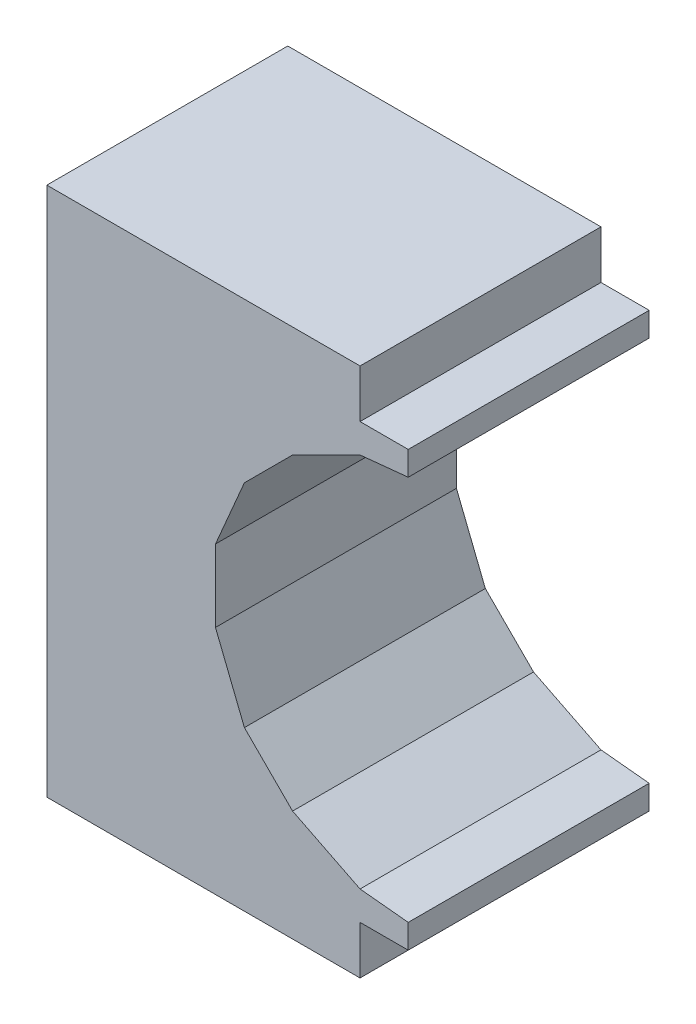
ISO-10303-21;
HEADER;
FILE_DESCRIPTION(('STEP AP214'),'2;1');
FILE_NAME('part.step','',(''),(''),'','','');
FILE_SCHEMA(('AUTOMOTIVE_DESIGN { 1 0 10303 214 1 1 1 1 }'));
ENDSEC;
DATA;
#1=APPLICATION_CONTEXT('core data for automotive mechanical design processes');
#2=APPLICATION_PROTOCOL_DEFINITION('international standard','automotive_design',2000,#1);
#3=PRODUCT_CONTEXT('',#1,'mechanical');
#4=PRODUCT('Part','Part','',(#3));
#5=PRODUCT_RELATED_PRODUCT_CATEGORY('part','',(#4));
#6=PRODUCT_DEFINITION_FORMATION('','',#4);
#7=PRODUCT_DEFINITION_CONTEXT('part definition',#1,'design');
#8=PRODUCT_DEFINITION('design','',#6,#7);
#9=PRODUCT_DEFINITION_SHAPE('','',#8);
#10=(LENGTH_UNIT() NAMED_UNIT(*) SI_UNIT(.MILLI.,.METRE.));
#11=(NAMED_UNIT(*) PLANE_ANGLE_UNIT() SI_UNIT($,.RADIAN.));
#12=(NAMED_UNIT(*) SI_UNIT($,.STERADIAN.) SOLID_ANGLE_UNIT());
#13=UNCERTAINTY_MEASURE_WITH_UNIT(LENGTH_MEASURE(1.E-05),#10,'distance_accuracy_value','');
#14=(GEOMETRIC_REPRESENTATION_CONTEXT(3) GLOBAL_UNCERTAINTY_ASSIGNED_CONTEXT((#13)) GLOBAL_UNIT_ASSIGNED_CONTEXT((#10,
#11,#12)) REPRESENTATION_CONTEXT('',''));
#15=CARTESIAN_POINT('',(0.,0.,0.));
#16=DIRECTION('',(0.,0.,1.));
#17=DIRECTION('',(1.,0.,0.));
#18=AXIS2_PLACEMENT_3D('',#15,#16,#17);
#19=CARTESIAN_POINT('',(0.37500052,-0.4499991,0.5));
#20=DIRECTION('',(0.,0.,-1.));
#21=DIRECTION('',(-1.,0.,0.));
#22=AXIS2_PLACEMENT_3D('',#19,#20,#21);
#23=PLANE('',#22);
#24=DIRECTION('',(-0.995037190209989,0.0995037190209989,0.));
#25=VECTOR('',#24,1.);
#26=CARTESIAN_POINT('',(0.27500072,-0.38999922,0.5));
#27=LINE('',#26,#25);
#28=CARTESIAN_POINT('',(0.27500072,-0.38999922,0.5));
#29=VERTEX_POINT('',#28);
#30=CARTESIAN_POINT('',(0.37500052,-0.3999992,0.5));
#31=VERTEX_POINT('',#30);
#32=EDGE_CURVE('E268',#29,#31,#27,.F.);
#33=ORIENTED_EDGE('',*,*,#32,.F.);
#34=DIRECTION('',(-0.894427190999916,0.447213595499958,0.));
#35=VECTOR('',#34,1.);
#36=CARTESIAN_POINT('',(0.135001,-0.31999936,0.5));
#37=LINE('',#36,#35);
#38=CARTESIAN_POINT('',(0.135001,-0.31999936,0.5));
#39=VERTEX_POINT('',#38);
#40=EDGE_CURVE('E261',#39,#29,#37,.F.);
#41=ORIENTED_EDGE('',*,*,#40,.F.);
#42=DIRECTION('',(-0.707106781186548,0.707106781186548,0.));
#43=VECTOR('',#42,1.);
#44=CARTESIAN_POINT('',(0.0350012,-0.21999956,0.5));
#45=LINE('',#44,#43);
#46=CARTESIAN_POINT('',(0.0350012,-0.21999956,0.5));
#47=VERTEX_POINT('',#46);
#48=EDGE_CURVE('E254',#47,#39,#45,.F.);
#49=ORIENTED_EDGE('',*,*,#48,.F.);
#50=DIRECTION('',(-0.371390676354104,0.928476690885259,0.));
#51=VECTOR('',#50,1.);
#52=CARTESIAN_POINT('',(-0.02499868,-0.06999986,0.5));
#53=LINE('',#52,#51);
#54=CARTESIAN_POINT('',(-0.02499868,-0.06999986,0.5));
#55=VERTEX_POINT('',#54);
#56=EDGE_CURVE('E247',#55,#47,#53,.F.);
#57=ORIENTED_EDGE('',*,*,#56,.F.);
#58=DIRECTION('',(0.,1.,0.));
#59=VECTOR('',#58,1.);
#60=CARTESIAN_POINT('',(-0.02499868,0.08000238,0.5));
#61=LINE('',#60,#59);
#62=CARTESIAN_POINT('',(-0.0249986799999908,0.080002379999996,0.5));
#63=VERTEX_POINT('',#62);
#64=EDGE_CURVE('E240',#63,#55,#61,.F.);
#65=ORIENTED_EDGE('',*,*,#64,.F.);
#66=DIRECTION('',(0.393919298579047,0.91914503001811,0.));
#67=VECTOR('',#66,1.);
#68=CARTESIAN_POINT('',(0.0350012,0.2200021,0.5));
#69=LINE('',#68,#67);
#70=CARTESIAN_POINT('',(0.0350012,0.2200021,0.5));
#71=VERTEX_POINT('',#70);
#72=EDGE_CURVE('E233',#71,#63,#69,.F.);
#73=ORIENTED_EDGE('',*,*,#72,.F.);
#74=DIRECTION('',(0.707106781186548,0.707106781186548,0.));
#75=VECTOR('',#74,1.);
#76=CARTESIAN_POINT('',(0.135001,0.3200019,0.5));
#77=LINE('',#76,#75);
#78=CARTESIAN_POINT('',(0.135001,0.3200019,0.5));
#79=VERTEX_POINT('',#78);
#80=EDGE_CURVE('E226',#79,#71,#77,.F.);
#81=ORIENTED_EDGE('',*,*,#80,.F.);
#82=DIRECTION('',(0.894427190999916,0.447213595499958,0.));
#83=VECTOR('',#82,1.);
#84=CARTESIAN_POINT('',(0.27500072,0.39000176,0.5));
#85=LINE('',#84,#83);
#86=CARTESIAN_POINT('',(0.27500072,0.390001759999995,0.5));
#87=VERTEX_POINT('',#86);
#88=EDGE_CURVE('E219',#87,#79,#85,.F.);
#89=ORIENTED_EDGE('',*,*,#88,.F.);
#90=DIRECTION('',(0.995039692277373,0.0994786951691173,0.));
#91=VECTOR('',#90,1.);
#92=CARTESIAN_POINT('',(0.37500052,0.3999992,0.5));
#93=LINE('',#92,#91);
#94=CARTESIAN_POINT('',(0.37500052,0.3999992,0.5));
#95=VERTEX_POINT('',#94);
#96=EDGE_CURVE('E213',#95,#87,#93,.F.);
#97=ORIENTED_EDGE('',*,*,#96,.F.);
#98=DIRECTION('',(0.,1.,0.));
#99=VECTOR('',#98,1.);
#100=CARTESIAN_POINT('',(0.37500052,0.45000164,0.5));
#101=LINE('',#100,#99);
#102=CARTESIAN_POINT('',(0.37500052,0.45000164,0.5));
#103=VERTEX_POINT('',#102);
#104=EDGE_CURVE('E206',#103,#95,#101,.F.);
#105=ORIENTED_EDGE('',*,*,#104,.F.);
#106=DIRECTION('',(1.,0.,0.));
#107=VECTOR('',#106,1.);
#108=CARTESIAN_POINT('',(0.27500072,0.45000164,0.5));
#109=LINE('',#108,#107);
#110=CARTESIAN_POINT('',(0.27500072,0.45000164,0.5));
#111=VERTEX_POINT('',#110);
#112=EDGE_CURVE('E199',#111,#103,#109,.T.);
#113=ORIENTED_EDGE('',*,*,#112,.F.);
#114=DIRECTION('',(0.,1.,0.));
#115=VECTOR('',#114,1.);
#116=CARTESIAN_POINT('',(0.27500072,0.55000144,0.5));
#117=LINE('',#116,#115);
#118=CARTESIAN_POINT('',(0.27500072,0.55000144,0.5));
#119=VERTEX_POINT('',#118);
#120=EDGE_CURVE('E192',#119,#111,#117,.F.);
#121=ORIENTED_EDGE('',*,*,#120,.F.);
#122=DIRECTION('',(1.,0.,0.));
#123=VECTOR('',#122,1.);
#124=CARTESIAN_POINT('',(-0.37499798,0.55000144,0.5));
#125=LINE('',#124,#123);
#126=CARTESIAN_POINT('',(-0.37499798,0.55000144,0.5));
#127=VERTEX_POINT('',#126);
#128=EDGE_CURVE('E185',#127,#119,#125,.T.);
#129=ORIENTED_EDGE('',*,*,#128,.F.);
#130=DIRECTION('',(0.,1.,0.));
#131=VECTOR('',#130,1.);
#132=CARTESIAN_POINT('',(-0.37499798,-0.55000144,0.5));
#133=LINE('',#132,#131);
#134=CARTESIAN_POINT('',(-0.37499798,-0.55000144,0.5));
#135=VERTEX_POINT('',#134);
#136=EDGE_CURVE('E178',#135,#127,#133,.T.);
#137=ORIENTED_EDGE('',*,*,#136,.F.);
#138=DIRECTION('',(1.,0.,0.));
#139=VECTOR('',#138,1.);
#140=CARTESIAN_POINT('',(0.27500072,-0.55000144,0.5));
#141=LINE('',#140,#139);
#142=CARTESIAN_POINT('',(0.27500072,-0.55000144,0.5));
#143=VERTEX_POINT('',#142);
#144=EDGE_CURVE('E155',#143,#135,#141,.F.);
#145=ORIENTED_EDGE('',*,*,#144,.F.);
#146=DIRECTION('',(0.,1.,0.));
#147=VECTOR('',#146,1.);
#148=CARTESIAN_POINT('',(0.27500072,-0.4499991,0.5));
#149=LINE('',#148,#147);
#150=CARTESIAN_POINT('',(0.27500072,-0.4499991,0.5));
#151=VERTEX_POINT('',#150);
#152=EDGE_CURVE('E139',#151,#143,#149,.F.);
#153=ORIENTED_EDGE('',*,*,#152,.F.);
#154=DIRECTION('',(1.,0.,0.));
#155=VECTOR('',#154,1.);
#156=CARTESIAN_POINT('',(0.37500052,-0.4499991,0.5));
#157=LINE('',#156,#155);
#158=CARTESIAN_POINT('',(0.37500052,-0.4499991,0.5));
#159=VERTEX_POINT('',#158);
#160=EDGE_CURVE('E19',#159,#151,#157,.F.);
#161=ORIENTED_EDGE('',*,*,#160,.F.);
#162=DIRECTION('',(0.,1.,0.));
#163=VECTOR('',#162,1.);
#164=CARTESIAN_POINT('',(0.37500052,-0.3999992,0.5));
#165=LINE('',#164,#163);
#166=EDGE_CURVE('E273',#31,#159,#165,.F.);
#167=ORIENTED_EDGE('',*,*,#166,.F.);
#168=EDGE_LOOP('',(#33,#41,#49,#57,#65,#73,#81,#89,#97,#105,#113,#121,#129,#137,#145,#153,#161,#167));
#169=FACE_BOUND('',#168,.T.);
#170=ADVANCED_FACE('F16',(#169),#23,.F.);
#171=CARTESIAN_POINT('',(0.37500052,-0.4499991,0.));
#172=DIRECTION('',(0.,-1.,0.));
#173=DIRECTION('',(0.,0.,-1.));
#174=AXIS2_PLACEMENT_3D('',#171,#172,#173);
#175=PLANE('',#174);
#176=DIRECTION('',(0.,0.,-1.));
#177=VECTOR('',#176,1.);
#178=CARTESIAN_POINT('',(0.27500072,-0.4499991,0.));
#179=LINE('',#178,#177);
#180=CARTESIAN_POINT('',(0.27500072,-0.4499991,0.));
#181=VERTEX_POINT('',#180);
#182=EDGE_CURVE('E145',#181,#151,#179,.F.);
#183=ORIENTED_EDGE('',*,*,#182,.F.);
#184=DIRECTION('',(-1.,0.,0.));
#185=VECTOR('',#184,1.);
#186=CARTESIAN_POINT('',(0.37500052,-0.4499991,0.));
#187=LINE('',#186,#185);
#188=CARTESIAN_POINT('',(0.37500052,-0.4499991,0.));
#189=VERTEX_POINT('',#188);
#190=EDGE_CURVE('E278',#189,#181,#187,.T.);
#191=ORIENTED_EDGE('',*,*,#190,.F.);
#192=DIRECTION('',(0.,0.,-1.));
#193=VECTOR('',#192,1.);
#194=CARTESIAN_POINT('',(0.37500052,-0.4499991,0.));
#195=LINE('',#194,#193);
#196=EDGE_CURVE('E148',#159,#189,#195,.T.);
#197=ORIENTED_EDGE('',*,*,#196,.F.);
#198=ORIENTED_EDGE('',*,*,#160,.T.);
#199=EDGE_LOOP('',(#183,#191,#197,#198));
#200=FACE_BOUND('',#199,.T.);
#201=ADVANCED_FACE('F144',(#200),#175,.T.);
#202=CARTESIAN_POINT('',(0.27500072,-0.4499991,0.));
#203=DIRECTION('',(1.,0.,0.));
#204=DIRECTION('',(0.,0.,-1.));
#205=AXIS2_PLACEMENT_3D('',#202,#203,#204);
#206=PLANE('',#205);
#207=DIRECTION('',(0.,0.,-1.));
#208=VECTOR('',#207,1.);
#209=CARTESIAN_POINT('',(0.27500072,-0.55000144,0.));
#210=LINE('',#209,#208);
#211=CARTESIAN_POINT('',(0.27500072,-0.55000144,0.));
#212=VERTEX_POINT('',#211);
#213=EDGE_CURVE('E158',#212,#143,#210,.F.);
#214=ORIENTED_EDGE('',*,*,#213,.F.);
#215=DIRECTION('',(0.,1.,0.));
#216=VECTOR('',#215,1.);
#217=CARTESIAN_POINT('',(0.27500072,-0.4499991,0.));
#218=LINE('',#217,#216);
#219=EDGE_CURVE('E162',#181,#212,#218,.F.);
#220=ORIENTED_EDGE('',*,*,#219,.F.);
#221=ORIENTED_EDGE('',*,*,#182,.T.);
#222=ORIENTED_EDGE('',*,*,#152,.T.);
#223=EDGE_LOOP('',(#214,#220,#221,#222));
#224=FACE_BOUND('',#223,.T.);
#225=ADVANCED_FACE('F160',(#224),#206,.T.);
#226=CARTESIAN_POINT('',(0.27500072,-0.55000144,0.));
#227=DIRECTION('',(0.,-1.,0.));
#228=DIRECTION('',(0.,0.,-1.));
#229=AXIS2_PLACEMENT_3D('',#226,#227,#228);
#230=PLANE('',#229);
#231=DIRECTION('',(0.,0.,1.));
#232=VECTOR('',#231,1.);
#233=CARTESIAN_POINT('',(-0.37499798,-0.55000144,0.));
#234=LINE('',#233,#232);
#235=CARTESIAN_POINT('',(-0.37499798,-0.55000144,0.));
#236=VERTEX_POINT('',#235);
#237=EDGE_CURVE('E174',#236,#135,#234,.T.);
#238=ORIENTED_EDGE('',*,*,#237,.F.);
#239=DIRECTION('',(-1.,0.,0.));
#240=VECTOR('',#239,1.);
#241=CARTESIAN_POINT('',(0.37500052,-0.55000144,0.));
#242=LINE('',#241,#240);
#243=EDGE_CURVE('E283',#212,#236,#242,.T.);
#244=ORIENTED_EDGE('',*,*,#243,.F.);
#245=ORIENTED_EDGE('',*,*,#213,.T.);
#246=ORIENTED_EDGE('',*,*,#144,.T.);
#247=EDGE_LOOP('',(#238,#244,#245,#246));
#248=FACE_BOUND('',#247,.T.);
#249=ADVANCED_FACE('F411',(#248),#230,.T.);
#250=CARTESIAN_POINT('',(-0.37499798,-0.55000144,0.));
#251=DIRECTION('',(-1.,0.,0.));
#252=DIRECTION('',(0.,0.,1.));
#253=AXIS2_PLACEMENT_3D('',#250,#251,#252);
#254=PLANE('',#253);
#255=DIRECTION('',(0.,0.,1.));
#256=VECTOR('',#255,1.);
#257=CARTESIAN_POINT('',(-0.37499798,0.55000144,0.));
#258=LINE('',#257,#256);
#259=CARTESIAN_POINT('',(-0.37499798,0.55000144,0.));
#260=VERTEX_POINT('',#259);
#261=EDGE_CURVE('E181',#260,#127,#258,.T.);
#262=ORIENTED_EDGE('',*,*,#261,.F.);
#263=DIRECTION('',(0.,1.,0.));
#264=VECTOR('',#263,1.);
#265=CARTESIAN_POINT('',(-0.37499798,-0.4499991,0.));
#266=LINE('',#265,#264);
#267=EDGE_CURVE('E287',#236,#260,#266,.T.);
#268=ORIENTED_EDGE('',*,*,#267,.F.);
#269=ORIENTED_EDGE('',*,*,#237,.T.);
#270=ORIENTED_EDGE('',*,*,#136,.T.);
#271=EDGE_LOOP('',(#262,#268,#269,#270));
#272=FACE_BOUND('',#271,.T.);
#273=ADVANCED_FACE('F407',(#272),#254,.T.);
#274=CARTESIAN_POINT('',(-0.37499798,0.55000144,0.));
#275=DIRECTION('',(0.,1.,0.));
#276=DIRECTION('',(0.,0.,1.));
#277=AXIS2_PLACEMENT_3D('',#274,#275,#276);
#278=PLANE('',#277);
#279=DIRECTION('',(0.,0.,-1.));
#280=VECTOR('',#279,1.);
#281=CARTESIAN_POINT('',(0.27500072,0.55000144,0.));
#282=LINE('',#281,#280);
#283=CARTESIAN_POINT('',(0.27500072,0.55000144,0.));
#284=VERTEX_POINT('',#283);
#285=EDGE_CURVE('E188',#284,#119,#282,.F.);
#286=ORIENTED_EDGE('',*,*,#285,.F.);
#287=DIRECTION('',(-1.,0.,0.));
#288=VECTOR('',#287,1.);
#289=CARTESIAN_POINT('',(0.37500052,0.55000144,0.));
#290=LINE('',#289,#288);
#291=EDGE_CURVE('E291',#260,#284,#290,.F.);
#292=ORIENTED_EDGE('',*,*,#291,.F.);
#293=ORIENTED_EDGE('',*,*,#261,.T.);
#294=ORIENTED_EDGE('',*,*,#128,.T.);
#295=EDGE_LOOP('',(#286,#292,#293,#294));
#296=FACE_BOUND('',#295,.T.);
#297=ADVANCED_FACE('F403',(#296),#278,.T.);
#298=CARTESIAN_POINT('',(0.27500072,0.55000144,0.));
#299=DIRECTION('',(1.,0.,0.));
#300=DIRECTION('',(0.,0.,-1.));
#301=AXIS2_PLACEMENT_3D('',#298,#299,#300);
#302=PLANE('',#301);
#303=DIRECTION('',(0.,0.,1.));
#304=VECTOR('',#303,1.);
#305=CARTESIAN_POINT('',(0.27500072,0.45000164,0.));
#306=LINE('',#305,#304);
#307=CARTESIAN_POINT('',(0.27500072,0.45000164,0.));
#308=VERTEX_POINT('',#307);
#309=EDGE_CURVE('E195',#308,#111,#306,.T.);
#310=ORIENTED_EDGE('',*,*,#309,.F.);
#311=DIRECTION('',(0.,1.,0.));
#312=VECTOR('',#311,1.);
#313=CARTESIAN_POINT('',(0.27500072,-0.4499991,0.));
#314=LINE('',#313,#312);
#315=EDGE_CURVE('E295',#284,#308,#314,.F.);
#316=ORIENTED_EDGE('',*,*,#315,.F.);
#317=ORIENTED_EDGE('',*,*,#285,.T.);
#318=ORIENTED_EDGE('',*,*,#120,.T.);
#319=EDGE_LOOP('',(#310,#316,#317,#318));
#320=FACE_BOUND('',#319,.T.);
#321=ADVANCED_FACE('F399',(#320),#302,.T.);
#322=CARTESIAN_POINT('',(0.27500072,0.45000164,0.));
#323=DIRECTION('',(0.,1.,0.));
#324=DIRECTION('',(0.,0.,1.));
#325=AXIS2_PLACEMENT_3D('',#322,#323,#324);
#326=PLANE('',#325);
#327=DIRECTION('',(0.,0.,-1.));
#328=VECTOR('',#327,1.);
#329=CARTESIAN_POINT('',(0.37500052,0.45000164,0.));
#330=LINE('',#329,#328);
#331=CARTESIAN_POINT('',(0.37500052,0.45000164,0.));
#332=VERTEX_POINT('',#331);
#333=EDGE_CURVE('E202',#332,#103,#330,.F.);
#334=ORIENTED_EDGE('',*,*,#333,.F.);
#335=DIRECTION('',(-1.,0.,0.));
#336=VECTOR('',#335,1.);
#337=CARTESIAN_POINT('',(0.37500052,0.45000164,0.));
#338=LINE('',#337,#336);
#339=EDGE_CURVE('E299',#308,#332,#338,.F.);
#340=ORIENTED_EDGE('',*,*,#339,.F.);
#341=ORIENTED_EDGE('',*,*,#309,.T.);
#342=ORIENTED_EDGE('',*,*,#112,.T.);
#343=EDGE_LOOP('',(#334,#340,#341,#342));
#344=FACE_BOUND('',#343,.T.);
#345=ADVANCED_FACE('F395',(#344),#326,.T.);
#346=CARTESIAN_POINT('',(0.37500052,0.45000164,0.));
#347=DIRECTION('',(1.,0.,0.));
#348=DIRECTION('',(0.,0.,-1.));
#349=AXIS2_PLACEMENT_3D('',#346,#347,#348);
#350=PLANE('',#349);
#351=DIRECTION('',(0.,0.,1.));
#352=VECTOR('',#351,1.);
#353=CARTESIAN_POINT('',(0.37500052,0.3999992,0.));
#354=LINE('',#353,#352);
#355=CARTESIAN_POINT('',(0.37500052,0.3999992,0.));
#356=VERTEX_POINT('',#355);
#357=EDGE_CURVE('E209',#356,#95,#354,.T.);
#358=ORIENTED_EDGE('',*,*,#357,.F.);
#359=DIRECTION('',(0.,1.,0.));
#360=VECTOR('',#359,1.);
#361=CARTESIAN_POINT('',(0.37500052,-0.4499991,0.));
#362=LINE('',#361,#360);
#363=EDGE_CURVE('E303',#332,#356,#362,.F.);
#364=ORIENTED_EDGE('',*,*,#363,.F.);
#365=ORIENTED_EDGE('',*,*,#333,.T.);
#366=ORIENTED_EDGE('',*,*,#104,.T.);
#367=EDGE_LOOP('',(#358,#364,#365,#366));
#368=FACE_BOUND('',#367,.T.);
#369=ADVANCED_FACE('F391',(#368),#350,.T.);
#370=CARTESIAN_POINT('',(0.37500052,0.3999992,0.));
#371=DIRECTION('',(0.0994786951691173,-0.995039692277373,0.));
#372=DIRECTION('',(0.995039692277373,0.0994786951691173,0.));
#373=AXIS2_PLACEMENT_3D('',#370,#371,#372);
#374=PLANE('',#373);
#375=DIRECTION('',(0.,0.,1.));
#376=VECTOR('',#375,1.);
#377=CARTESIAN_POINT('',(0.27500072,0.39000176,0.));
#378=LINE('',#377,#376);
#379=CARTESIAN_POINT('',(0.27500072,0.390001759999995,0.));
#380=VERTEX_POINT('',#379);
#381=EDGE_CURVE('E216',#380,#87,#378,.T.);
#382=ORIENTED_EDGE('',*,*,#381,.F.);
#383=DIRECTION('',(-0.995039692277384,-0.099478695169006,0.));
#384=VECTOR('',#383,1.);
#385=CARTESIAN_POINT('',(0.37500052,0.3999992,0.));
#386=LINE('',#385,#384);
#387=EDGE_CURVE('E307',#356,#380,#386,.T.);
#388=ORIENTED_EDGE('',*,*,#387,.F.);
#389=ORIENTED_EDGE('',*,*,#357,.T.);
#390=ORIENTED_EDGE('',*,*,#96,.T.);
#391=EDGE_LOOP('',(#382,#388,#389,#390));
#392=FACE_BOUND('',#391,.T.);
#393=ADVANCED_FACE('F387',(#392),#374,.T.);
#394=CARTESIAN_POINT('',(0.27500072,0.39000176,0.));
#395=DIRECTION('',(0.447213595499958,-0.894427190999916,0.));
#396=DIRECTION('',(0.894427190999916,0.447213595499958,0.));
#397=AXIS2_PLACEMENT_3D('',#394,#395,#396);
#398=PLANE('',#397);
#399=DIRECTION('',(0.,0.,1.));
#400=VECTOR('',#399,1.);
#401=CARTESIAN_POINT('',(0.135001,0.3200019,0.));
#402=LINE('',#401,#400);
#403=CARTESIAN_POINT('',(0.135001,0.3200019,0.));
#404=VERTEX_POINT('',#403);
#405=EDGE_CURVE('E222',#404,#79,#402,.T.);
#406=ORIENTED_EDGE('',*,*,#405,.F.);
#407=DIRECTION('',(-0.894427190999916,-0.447213595499959,0.));
#408=VECTOR('',#407,1.);
#409=CARTESIAN_POINT('',(0.27500072,0.39000176,0.));
#410=LINE('',#409,#408);
#411=EDGE_CURVE('E311',#380,#404,#410,.T.);
#412=ORIENTED_EDGE('',*,*,#411,.F.);
#413=ORIENTED_EDGE('',*,*,#381,.T.);
#414=ORIENTED_EDGE('',*,*,#88,.T.);
#415=EDGE_LOOP('',(#406,#412,#413,#414));
#416=FACE_BOUND('',#415,.T.);
#417=ADVANCED_FACE('F383',(#416),#398,.T.);
#418=CARTESIAN_POINT('',(0.135001,0.3200019,0.));
#419=DIRECTION('',(0.707106781186548,-0.707106781186548,0.));
#420=DIRECTION('',(0.707106781186548,0.707106781186548,0.));
#421=AXIS2_PLACEMENT_3D('',#418,#419,#420);
#422=PLANE('',#421);
#423=DIRECTION('',(0.,0.,1.));
#424=VECTOR('',#423,1.);
#425=CARTESIAN_POINT('',(0.0350012,0.2200021,0.));
#426=LINE('',#425,#424);
#427=CARTESIAN_POINT('',(0.0350012,0.2200021,0.));
#428=VERTEX_POINT('',#427);
#429=EDGE_CURVE('E229',#428,#71,#426,.T.);
#430=ORIENTED_EDGE('',*,*,#429,.F.);
#431=DIRECTION('',(-0.707106781186548,-0.707106781186548,0.));
#432=VECTOR('',#431,1.);
#433=CARTESIAN_POINT('',(0.135001,0.3200019,0.));
#434=LINE('',#433,#432);
#435=EDGE_CURVE('E315',#404,#428,#434,.T.);
#436=ORIENTED_EDGE('',*,*,#435,.F.);
#437=ORIENTED_EDGE('',*,*,#405,.T.);
#438=ORIENTED_EDGE('',*,*,#80,.T.);
#439=EDGE_LOOP('',(#430,#436,#437,#438));
#440=FACE_BOUND('',#439,.T.);
#441=ADVANCED_FACE('F379',(#440),#422,.T.);
#442=CARTESIAN_POINT('',(0.0350012,0.2200021,0.));
#443=DIRECTION('',(0.91914503001811,-0.393919298579047,0.));
#444=DIRECTION('',(0.393919298579047,0.91914503001811,0.));
#445=AXIS2_PLACEMENT_3D('',#442,#443,#444);
#446=PLANE('',#445);
#447=DIRECTION('',(0.,0.,-1.));
#448=VECTOR('',#447,1.);
#449=CARTESIAN_POINT('',(-0.02499868,0.08000238,0.));
#450=LINE('',#449,#448);
#451=CARTESIAN_POINT('',(-0.0249986799999908,0.080002379999996,0.));
#452=VERTEX_POINT('',#451);
#453=EDGE_CURVE('E236',#452,#63,#450,.F.);
#454=ORIENTED_EDGE('',*,*,#453,.F.);
#455=DIRECTION('',(-0.393919298579168,-0.919145030018058,0.));
#456=VECTOR('',#455,1.);
#457=CARTESIAN_POINT('',(0.0350012,0.2200021,0.));
#458=LINE('',#457,#456);
#459=EDGE_CURVE('E319',#428,#452,#458,.T.);
#460=ORIENTED_EDGE('',*,*,#459,.F.);
#461=ORIENTED_EDGE('',*,*,#429,.T.);
#462=ORIENTED_EDGE('',*,*,#72,.T.);
#463=EDGE_LOOP('',(#454,#460,#461,#462));
#464=FACE_BOUND('',#463,.T.);
#465=ADVANCED_FACE('F375',(#464),#446,.T.);
#466=CARTESIAN_POINT('',(-0.02499868,0.08000238,0.));
#467=DIRECTION('',(1.,0.,0.));
#468=DIRECTION('',(0.,0.,-1.));
#469=AXIS2_PLACEMENT_3D('',#466,#467,#468);
#470=PLANE('',#469);
#471=DIRECTION('',(0.,0.,1.));
#472=VECTOR('',#471,1.);
#473=CARTESIAN_POINT('',(-0.02499868,-0.06999986,0.));
#474=LINE('',#473,#472);
#475=CARTESIAN_POINT('',(-0.02499868,-0.06999986,0.));
#476=VERTEX_POINT('',#475);
#477=EDGE_CURVE('E243',#476,#55,#474,.T.);
#478=ORIENTED_EDGE('',*,*,#477,.F.);
#479=DIRECTION('',(0.,1.,0.));
#480=VECTOR('',#479,1.);
#481=CARTESIAN_POINT('',(-0.02499868,-0.4499991,0.));
#482=LINE('',#481,#480);
#483=EDGE_CURVE('E323',#452,#476,#482,.F.);
#484=ORIENTED_EDGE('',*,*,#483,.F.);
#485=ORIENTED_EDGE('',*,*,#453,.T.);
#486=ORIENTED_EDGE('',*,*,#64,.T.);
#487=EDGE_LOOP('',(#478,#484,#485,#486));
#488=FACE_BOUND('',#487,.T.);
#489=ADVANCED_FACE('F371',(#488),#470,.T.);
#490=CARTESIAN_POINT('',(-0.02499868,-0.06999986,0.));
#491=DIRECTION('',(0.928476690885259,0.371390676354104,0.));
#492=DIRECTION('',(-0.371390676354104,0.928476690885259,0.));
#493=AXIS2_PLACEMENT_3D('',#490,#491,#492);
#494=PLANE('',#493);
#495=DIRECTION('',(0.,0.,1.));
#496=VECTOR('',#495,1.);
#497=CARTESIAN_POINT('',(0.0350012,-0.21999956,0.));
#498=LINE('',#497,#496);
#499=CARTESIAN_POINT('',(0.0350012,-0.21999956,0.));
#500=VERTEX_POINT('',#499);
#501=EDGE_CURVE('E250',#500,#47,#498,.T.);
#502=ORIENTED_EDGE('',*,*,#501,.F.);
#503=DIRECTION('',(0.371390676354104,-0.928476690885259,0.));
#504=VECTOR('',#503,1.);
#505=CARTESIAN_POINT('',(-0.02499868,-0.06999986,0.));
#506=LINE('',#505,#504);
#507=EDGE_CURVE('E327',#476,#500,#506,.T.);
#508=ORIENTED_EDGE('',*,*,#507,.F.);
#509=ORIENTED_EDGE('',*,*,#477,.T.);
#510=ORIENTED_EDGE('',*,*,#56,.T.);
#511=EDGE_LOOP('',(#502,#508,#509,#510));
#512=FACE_BOUND('',#511,.T.);
#513=ADVANCED_FACE('F367',(#512),#494,.T.);
#514=CARTESIAN_POINT('',(0.0350012,-0.21999956,0.));
#515=DIRECTION('',(0.707106781186548,0.707106781186548,0.));
#516=DIRECTION('',(-0.707106781186548,0.707106781186548,0.));
#517=AXIS2_PLACEMENT_3D('',#514,#515,#516);
#518=PLANE('',#517);
#519=DIRECTION('',(0.,0.,1.));
#520=VECTOR('',#519,1.);
#521=CARTESIAN_POINT('',(0.135001,-0.31999936,0.));
#522=LINE('',#521,#520);
#523=CARTESIAN_POINT('',(0.135001,-0.31999936,0.));
#524=VERTEX_POINT('',#523);
#525=EDGE_CURVE('E257',#524,#39,#522,.T.);
#526=ORIENTED_EDGE('',*,*,#525,.F.);
#527=DIRECTION('',(0.707106781186548,-0.707106781186548,0.));
#528=VECTOR('',#527,1.);
#529=CARTESIAN_POINT('',(0.0350012,-0.21999956,0.));
#530=LINE('',#529,#528);
#531=EDGE_CURVE('E331',#500,#524,#530,.T.);
#532=ORIENTED_EDGE('',*,*,#531,.F.);
#533=ORIENTED_EDGE('',*,*,#501,.T.);
#534=ORIENTED_EDGE('',*,*,#48,.T.);
#535=EDGE_LOOP('',(#526,#532,#533,#534));
#536=FACE_BOUND('',#535,.T.);
#537=ADVANCED_FACE('F364',(#536),#518,.T.);
#538=CARTESIAN_POINT('',(0.135001,-0.31999936,0.));
#539=DIRECTION('',(0.447213595499958,0.894427190999916,0.));
#540=DIRECTION('',(-0.894427190999916,0.447213595499958,0.));
#541=AXIS2_PLACEMENT_3D('',#538,#539,#540);
#542=PLANE('',#541);
#543=DIRECTION('',(0.,0.,1.));
#544=VECTOR('',#543,1.);
#545=CARTESIAN_POINT('',(0.27500072,-0.38999922,0.));
#546=LINE('',#545,#544);
#547=CARTESIAN_POINT('',(0.27500072,-0.38999922,0.));
#548=VERTEX_POINT('',#547);
#549=EDGE_CURVE('E264',#548,#29,#546,.T.);
#550=ORIENTED_EDGE('',*,*,#549,.F.);
#551=DIRECTION('',(0.894427190999916,-0.447213595499958,0.));
#552=VECTOR('',#551,1.);
#553=CARTESIAN_POINT('',(0.135001,-0.31999936,0.));
#554=LINE('',#553,#552);
#555=EDGE_CURVE('E335',#524,#548,#554,.T.);
#556=ORIENTED_EDGE('',*,*,#555,.F.);
#557=ORIENTED_EDGE('',*,*,#525,.T.);
#558=ORIENTED_EDGE('',*,*,#40,.T.);
#559=EDGE_LOOP('',(#550,#556,#557,#558));
#560=FACE_BOUND('',#559,.T.);
#561=ADVANCED_FACE('F346',(#560),#542,.T.);
#562=CARTESIAN_POINT('',(0.27500072,-0.38999922,0.));
#563=DIRECTION('',(0.0995037190209989,0.995037190209989,0.));
#564=DIRECTION('',(-0.995037190209989,0.0995037190209989,0.));
#565=AXIS2_PLACEMENT_3D('',#562,#563,#564);
#566=PLANE('',#565);
#567=DIRECTION('',(0.,0.,-1.));
#568=VECTOR('',#567,1.);
#569=CARTESIAN_POINT('',(0.37500052,-0.3999992,0.));
#570=LINE('',#569,#568);
#571=CARTESIAN_POINT('',(0.37500052,-0.3999992,0.));
#572=VERTEX_POINT('',#571);
#573=EDGE_CURVE('E35',#572,#31,#570,.F.);
#574=ORIENTED_EDGE('',*,*,#573,.F.);
#575=DIRECTION('',(0.995037190209989,-0.0995037190209994,0.));
#576=VECTOR('',#575,1.);
#577=CARTESIAN_POINT('',(0.27500072,-0.38999922,0.));
#578=LINE('',#577,#576);
#579=EDGE_CURVE('E26',#548,#572,#578,.T.);
#580=ORIENTED_EDGE('',*,*,#579,.F.);
#581=ORIENTED_EDGE('',*,*,#549,.T.);
#582=ORIENTED_EDGE('',*,*,#32,.T.);
#583=EDGE_LOOP('',(#574,#580,#581,#582));
#584=FACE_BOUND('',#583,.T.);
#585=ADVANCED_FACE('F344',(#584),#566,.T.);
#586=CARTESIAN_POINT('',(0.37500052,-0.3999992,0.));
#587=DIRECTION('',(1.,0.,0.));
#588=DIRECTION('',(0.,0.,-1.));
#589=AXIS2_PLACEMENT_3D('',#586,#587,#588);
#590=PLANE('',#589);
#591=ORIENTED_EDGE('',*,*,#196,.T.);
#592=DIRECTION('',(0.,1.,0.));
#593=VECTOR('',#592,1.);
#594=CARTESIAN_POINT('',(0.37500052,-0.4499991,0.));
#595=LINE('',#594,#593);
#596=EDGE_CURVE('E11',#572,#189,#595,.F.);
#597=ORIENTED_EDGE('',*,*,#596,.F.);
#598=ORIENTED_EDGE('',*,*,#573,.T.);
#599=ORIENTED_EDGE('',*,*,#166,.T.);
#600=EDGE_LOOP('',(#591,#597,#598,#599));
#601=FACE_BOUND('',#600,.T.);
#602=ADVANCED_FACE('F350',(#601),#590,.T.);
#603=CARTESIAN_POINT('',(0.37500052,-0.4499991,0.));
#604=DIRECTION('',(0.,0.,-1.));
#605=DIRECTION('',(-1.,0.,0.));
#606=AXIS2_PLACEMENT_3D('',#603,#604,#605);
#607=PLANE('',#606);
#608=ORIENTED_EDGE('',*,*,#579,.T.);
#609=ORIENTED_EDGE('',*,*,#596,.T.);
#610=ORIENTED_EDGE('',*,*,#190,.T.);
#611=ORIENTED_EDGE('',*,*,#219,.T.);
#612=ORIENTED_EDGE('',*,*,#243,.T.);
#613=ORIENTED_EDGE('',*,*,#267,.T.);
#614=ORIENTED_EDGE('',*,*,#291,.T.);
#615=ORIENTED_EDGE('',*,*,#315,.T.);
#616=ORIENTED_EDGE('',*,*,#339,.T.);
#617=ORIENTED_EDGE('',*,*,#363,.T.);
#618=ORIENTED_EDGE('',*,*,#387,.T.);
#619=ORIENTED_EDGE('',*,*,#411,.T.);
#620=ORIENTED_EDGE('',*,*,#435,.T.);
#621=ORIENTED_EDGE('',*,*,#459,.T.);
#622=ORIENTED_EDGE('',*,*,#483,.T.);
#623=ORIENTED_EDGE('',*,*,#507,.T.);
#624=ORIENTED_EDGE('',*,*,#531,.T.);
#625=ORIENTED_EDGE('',*,*,#555,.T.);
#626=EDGE_LOOP('',(#608,#609,#610,#611,#612,#613,#614,#615,#616,#617,#618,#619,#620,#621,#622,
#623,#624,#625));
#627=FACE_BOUND('',#626,.T.);
#628=ADVANCED_FACE('F342',(#627),#607,.T.);
#629=CLOSED_SHELL('',(#170,#201,#225,#249,#273,#297,#321,#345,#369,#393,#417,#441,#465,#489,
#513,#537,#561,#585,#602,#628));
#630=MANIFOLD_SOLID_BREP('B1',#629);
#631=ADVANCED_BREP_SHAPE_REPRESENTATION('',(#18,#630),#14);
#632=SHAPE_DEFINITION_REPRESENTATION(#9,#631);
ENDSEC;
END-ISO-10303-21;
